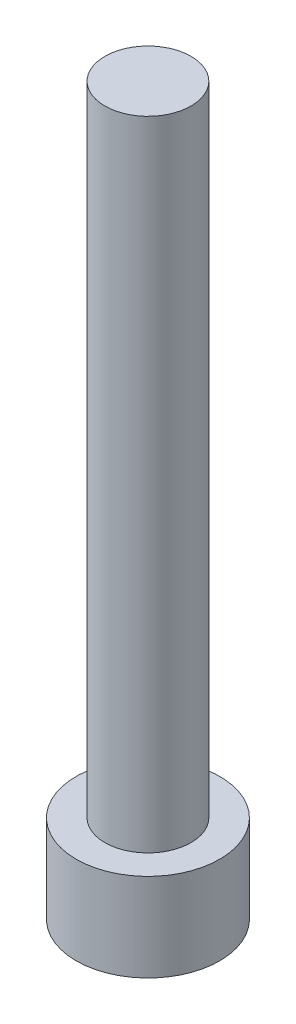
ISO-10303-21;
HEADER;
FILE_DESCRIPTION(('STEP AP214'),'2;1');
FILE_NAME('part.step','',(''),(''),'','','');
FILE_SCHEMA(('AUTOMOTIVE_DESIGN { 1 0 10303 214 1 1 1 1 }'));
ENDSEC;
DATA;
#1=APPLICATION_CONTEXT('core data for automotive mechanical design processes');
#2=APPLICATION_PROTOCOL_DEFINITION('international standard','automotive_design',2000,#1);
#3=PRODUCT_CONTEXT('',#1,'mechanical');
#4=PRODUCT('Part','Part','',(#3));
#5=PRODUCT_RELATED_PRODUCT_CATEGORY('part','',(#4));
#6=PRODUCT_DEFINITION_FORMATION('','',#4);
#7=PRODUCT_DEFINITION_CONTEXT('part definition',#1,'design');
#8=PRODUCT_DEFINITION('design','',#6,#7);
#9=PRODUCT_DEFINITION_SHAPE('','',#8);
#10=(LENGTH_UNIT() NAMED_UNIT(*) SI_UNIT(.MILLI.,.METRE.));
#11=(NAMED_UNIT(*) PLANE_ANGLE_UNIT() SI_UNIT($,.RADIAN.));
#12=(NAMED_UNIT(*) SI_UNIT($,.STERADIAN.) SOLID_ANGLE_UNIT());
#13=UNCERTAINTY_MEASURE_WITH_UNIT(LENGTH_MEASURE(1.E-05),#10,'distance_accuracy_value','');
#14=(GEOMETRIC_REPRESENTATION_CONTEXT(3) GLOBAL_UNCERTAINTY_ASSIGNED_CONTEXT((#13)) GLOBAL_UNIT_ASSIGNED_CONTEXT((#10,
#11,#12)) REPRESENTATION_CONTEXT('',''));
#15=CARTESIAN_POINT('',(0.,0.,0.));
#16=DIRECTION('',(0.,0.,1.));
#17=DIRECTION('',(1.,0.,0.));
#18=AXIS2_PLACEMENT_3D('',#15,#16,#17);
#19=CARTESIAN_POINT('',(0.,3.5052,0.));
#20=DIRECTION('',(0.,1.,0.));
#21=DIRECTION('',(0.,0.,1.));
#22=AXIS2_PLACEMENT_3D('',#19,#20,#21);
#23=PLANE('',#22);
#24=CARTESIAN_POINT('',(0.,3.5052,0.));
#25=DIRECTION('',(0.,1.,0.));
#26=DIRECTION('',(0.,0.,1.));
#27=AXIS2_PLACEMENT_3D('',#24,#25,#26);
#28=CIRCLE('',#27,2.8575);
#29=CARTESIAN_POINT('',(0.,3.5052,2.8575));
#30=VERTEX_POINT('',#29);
#31=EDGE_CURVE('E11',#30,#30,#28,.T.);
#32=ORIENTED_EDGE('',*,*,#31,.T.);
#33=EDGE_LOOP('',(#32));
#34=FACE_BOUND('',#33,.T.);
#35=CARTESIAN_POINT('',(0.,3.5052,0.));
#36=DIRECTION('',(0.,1.,0.));
#37=DIRECTION('',(0.,0.,1.));
#38=AXIS2_PLACEMENT_3D('',#35,#36,#37);
#39=CIRCLE('',#38,1.7145);
#40=CARTESIAN_POINT('',(0.,3.5052,1.7145));
#41=VERTEX_POINT('',#40);
#42=EDGE_CURVE('E152',#41,#41,#39,.T.);
#43=ORIENTED_EDGE('',*,*,#42,.F.);
#44=EDGE_LOOP('',(#43));
#45=FACE_BOUND('',#44,.T.);
#46=ADVANCED_FACE('F33',(#34,#45),#23,.T.);
#47=CARTESIAN_POINT('',(0.,3.5052,0.));
#48=DIRECTION('',(0.,-1.,0.));
#49=DIRECTION('',(0.,0.,-1.));
#50=AXIS2_PLACEMENT_3D('',#47,#48,#49);
#51=CYLINDRICAL_SURFACE('',#50,2.8575);
#52=ORIENTED_EDGE('',*,*,#31,.F.);
#53=EDGE_LOOP('',(#52));
#54=FACE_BOUND('',#53,.T.);
#55=CARTESIAN_POINT('',(0.,0.,0.));
#56=DIRECTION('',(0.,1.,0.));
#57=DIRECTION('',(0.,0.,1.));
#58=AXIS2_PLACEMENT_3D('',#55,#56,#57);
#59=CIRCLE('',#58,2.8575);
#60=CARTESIAN_POINT('',(0.,0.,2.8575));
#61=VERTEX_POINT('',#60);
#62=EDGE_CURVE('E37',#61,#61,#59,.T.);
#63=ORIENTED_EDGE('',*,*,#62,.T.);
#64=EDGE_LOOP('',(#63));
#65=FACE_BOUND('',#64,.T.);
#66=ADVANCED_FACE('F35',(#54,#65),#51,.T.);
#67=CARTESIAN_POINT('',(0.,0.,0.));
#68=DIRECTION('',(0.,1.,0.));
#69=DIRECTION('',(0.,0.,1.));
#70=AXIS2_PLACEMENT_3D('',#67,#68,#69);
#71=PLANE('',#70);
#72=DIRECTION('',(-0.500000000000001,0.,0.866025403784438));
#73=VECTOR('',#72,1.);
#74=CARTESIAN_POINT('',(1.60395121659243,0.,0.));
#75=LINE('',#74,#73);
#76=CARTESIAN_POINT('',(1.60395121659243,0.,0.));
#77=VERTEX_POINT('',#76);
#78=CARTESIAN_POINT('',(0.801975608296214,0.,1.3890625));
#79=VERTEX_POINT('',#78);
#80=EDGE_CURVE('E122',#77,#79,#75,.T.);
#81=ORIENTED_EDGE('',*,*,#80,.F.);
#82=DIRECTION('',(0.5,0.,0.866025403784439));
#83=VECTOR('',#82,1.);
#84=CARTESIAN_POINT('',(0.801975608296215,0.,-1.3890625));
#85=LINE('',#84,#83);
#86=CARTESIAN_POINT('',(0.801975608296215,0.,-1.3890625));
#87=VERTEX_POINT('',#86);
#88=EDGE_CURVE('E48',#87,#77,#85,.T.);
#89=ORIENTED_EDGE('',*,*,#88,.F.);
#90=DIRECTION('',(1.,0.,0.));
#91=VECTOR('',#90,1.);
#92=CARTESIAN_POINT('',(-0.801975608296214,0.,-1.3890625));
#93=LINE('',#92,#91);
#94=CARTESIAN_POINT('',(-0.801975608296214,0.,-1.3890625));
#95=VERTEX_POINT('',#94);
#96=EDGE_CURVE('E132',#95,#87,#93,.T.);
#97=ORIENTED_EDGE('',*,*,#96,.F.);
#98=DIRECTION('',(0.5,0.,-0.866025403784438));
#99=VECTOR('',#98,1.);
#100=CARTESIAN_POINT('',(-1.60395121659243,0.,0.));
#101=LINE('',#100,#99);
#102=CARTESIAN_POINT('',(-1.60395121659243,0.,0.));
#103=VERTEX_POINT('',#102);
#104=EDGE_CURVE('E130',#103,#95,#101,.T.);
#105=ORIENTED_EDGE('',*,*,#104,.F.);
#106=DIRECTION('',(-0.5,0.,-0.866025403784439));
#107=VECTOR('',#106,1.);
#108=CARTESIAN_POINT('',(-0.801975608296214,0.,1.3890625));
#109=LINE('',#108,#107);
#110=CARTESIAN_POINT('',(-0.801975608296214,0.,1.3890625));
#111=VERTEX_POINT('',#110);
#112=EDGE_CURVE('E96',#111,#103,#109,.T.);
#113=ORIENTED_EDGE('',*,*,#112,.F.);
#114=DIRECTION('',(-1.,0.,0.));
#115=VECTOR('',#114,1.);
#116=CARTESIAN_POINT('',(0.801975608296214,0.,1.3890625));
#117=LINE('',#116,#115);
#118=EDGE_CURVE('E126',#79,#111,#117,.T.);
#119=ORIENTED_EDGE('',*,*,#118,.F.);
#120=EDGE_LOOP('',(#81,#89,#97,#105,#113,#119));
#121=FACE_BOUND('',#120,.T.);
#122=ORIENTED_EDGE('',*,*,#62,.F.);
#123=EDGE_LOOP('',(#122));
#124=FACE_BOUND('',#123,.T.);
#125=ADVANCED_FACE('F145',(#121,#124),#71,.F.);
#126=CARTESIAN_POINT('',(0.801975608296215,1.9558,-1.3890625));
#127=DIRECTION('',(0.866025403784438,0.,-0.5));
#128=DIRECTION('',(-0.5,0.,-0.866025403784439));
#129=AXIS2_PLACEMENT_3D('',#126,#127,#128);
#130=PLANE('',#129);
#131=ORIENTED_EDGE('',*,*,#88,.T.);
#132=DIRECTION('',(0.,-1.,0.));
#133=VECTOR('',#132,1.);
#134=CARTESIAN_POINT('',(1.60395121659243,1.9558,0.));
#135=LINE('',#134,#133);
#136=CARTESIAN_POINT('',(1.60395121659243,1.9558,0.));
#137=VERTEX_POINT('',#136);
#138=EDGE_CURVE('E78',#137,#77,#135,.T.);
#139=ORIENTED_EDGE('',*,*,#138,.F.);
#140=DIRECTION('',(0.5,0.,0.866025403784439));
#141=VECTOR('',#140,1.);
#142=CARTESIAN_POINT('',(0.801975608296215,1.9558,-1.3890625));
#143=LINE('',#142,#141);
#144=CARTESIAN_POINT('',(0.801975608296215,1.9558,-1.3890625));
#145=VERTEX_POINT('',#144);
#146=EDGE_CURVE('E134',#145,#137,#143,.T.);
#147=ORIENTED_EDGE('',*,*,#146,.F.);
#148=DIRECTION('',(0.,-1.,0.));
#149=VECTOR('',#148,1.);
#150=CARTESIAN_POINT('',(0.801975608296215,1.9558,-1.3890625));
#151=LINE('',#150,#149);
#152=EDGE_CURVE('E56',#145,#87,#151,.T.);
#153=ORIENTED_EDGE('',*,*,#152,.T.);
#154=EDGE_LOOP('',(#131,#139,#147,#153));
#155=FACE_BOUND('',#154,.T.);
#156=ADVANCED_FACE('F174',(#155),#130,.F.);
#157=CARTESIAN_POINT('',(-0.801975608296214,1.9558,-1.3890625));
#158=DIRECTION('',(0.,0.,-1.));
#159=DIRECTION('',(-1.,0.,0.));
#160=AXIS2_PLACEMENT_3D('',#157,#158,#159);
#161=PLANE('',#160);
#162=ORIENTED_EDGE('',*,*,#96,.T.);
#163=ORIENTED_EDGE('',*,*,#152,.F.);
#164=DIRECTION('',(1.,0.,0.));
#165=VECTOR('',#164,1.);
#166=CARTESIAN_POINT('',(-0.801975608296214,1.9558,-1.3890625));
#167=LINE('',#166,#165);
#168=CARTESIAN_POINT('',(-0.801975608296214,1.9558,-1.3890625));
#169=VERTEX_POINT('',#168);
#170=EDGE_CURVE('E108',#169,#145,#167,.T.);
#171=ORIENTED_EDGE('',*,*,#170,.F.);
#172=DIRECTION('',(0.,-1.,0.));
#173=VECTOR('',#172,1.);
#174=CARTESIAN_POINT('',(-0.801975608296214,1.9558,-1.3890625));
#175=LINE('',#174,#173);
#176=EDGE_CURVE('E100',#169,#95,#175,.T.);
#177=ORIENTED_EDGE('',*,*,#176,.T.);
#178=EDGE_LOOP('',(#162,#163,#171,#177));
#179=FACE_BOUND('',#178,.T.);
#180=ADVANCED_FACE('F180',(#179),#161,.F.);
#181=CARTESIAN_POINT('',(-1.60395121659243,1.9558,0.));
#182=DIRECTION('',(-0.866025403784438,0.,-0.5));
#183=DIRECTION('',(-0.5,0.,0.866025403784439));
#184=AXIS2_PLACEMENT_3D('',#181,#182,#183);
#185=PLANE('',#184);
#186=ORIENTED_EDGE('',*,*,#104,.T.);
#187=ORIENTED_EDGE('',*,*,#176,.F.);
#188=DIRECTION('',(0.5,0.,-0.866025403784438));
#189=VECTOR('',#188,1.);
#190=CARTESIAN_POINT('',(-1.60395121659243,1.9558,0.));
#191=LINE('',#190,#189);
#192=CARTESIAN_POINT('',(-1.60395121659243,1.9558,0.));
#193=VERTEX_POINT('',#192);
#194=EDGE_CURVE('E104',#193,#169,#191,.T.);
#195=ORIENTED_EDGE('',*,*,#194,.F.);
#196=DIRECTION('',(0.,-1.,0.));
#197=VECTOR('',#196,1.);
#198=CARTESIAN_POINT('',(-1.60395121659243,1.9558,0.));
#199=LINE('',#198,#197);
#200=EDGE_CURVE('E89',#193,#103,#199,.T.);
#201=ORIENTED_EDGE('',*,*,#200,.T.);
#202=EDGE_LOOP('',(#186,#187,#195,#201));
#203=FACE_BOUND('',#202,.T.);
#204=ADVANCED_FACE('F105',(#203),#185,.F.);
#205=CARTESIAN_POINT('',(-0.801975608296214,1.9558,1.3890625));
#206=DIRECTION('',(-0.866025403784439,0.,0.5));
#207=DIRECTION('',(0.5,0.,0.866025403784439));
#208=AXIS2_PLACEMENT_3D('',#205,#206,#207);
#209=PLANE('',#208);
#210=ORIENTED_EDGE('',*,*,#112,.T.);
#211=ORIENTED_EDGE('',*,*,#200,.F.);
#212=DIRECTION('',(-0.5,0.,-0.866025403784439));
#213=VECTOR('',#212,1.);
#214=CARTESIAN_POINT('',(-0.801975608296214,1.9558,1.3890625));
#215=LINE('',#214,#213);
#216=CARTESIAN_POINT('',(-0.801975608296214,1.9558,1.3890625));
#217=VERTEX_POINT('',#216);
#218=EDGE_CURVE('E93',#217,#193,#215,.T.);
#219=ORIENTED_EDGE('',*,*,#218,.F.);
#220=DIRECTION('',(0.,-1.,0.));
#221=VECTOR('',#220,1.);
#222=CARTESIAN_POINT('',(-0.801975608296214,1.9558,1.3890625));
#223=LINE('',#222,#221);
#224=EDGE_CURVE('E101',#217,#111,#223,.T.);
#225=ORIENTED_EDGE('',*,*,#224,.T.);
#226=EDGE_LOOP('',(#210,#211,#219,#225));
#227=FACE_BOUND('',#226,.T.);
#228=ADVANCED_FACE('F91',(#227),#209,.F.);
#229=CARTESIAN_POINT('',(0.801975608296214,1.9558,1.3890625));
#230=DIRECTION('',(0.,0.,1.));
#231=DIRECTION('',(1.,0.,0.));
#232=AXIS2_PLACEMENT_3D('',#229,#230,#231);
#233=PLANE('',#232);
#234=ORIENTED_EDGE('',*,*,#118,.T.);
#235=ORIENTED_EDGE('',*,*,#224,.F.);
#236=DIRECTION('',(-1.,0.,0.));
#237=VECTOR('',#236,1.);
#238=CARTESIAN_POINT('',(0.801975608296214,1.9558,1.3890625));
#239=LINE('',#238,#237);
#240=CARTESIAN_POINT('',(0.801975608296214,1.9558,1.3890625));
#241=VERTEX_POINT('',#240);
#242=EDGE_CURVE('E114',#241,#217,#239,.T.);
#243=ORIENTED_EDGE('',*,*,#242,.F.);
#244=DIRECTION('',(0.,-1.,0.));
#245=VECTOR('',#244,1.);
#246=CARTESIAN_POINT('',(0.801975608296214,1.9558,1.3890625));
#247=LINE('',#246,#245);
#248=EDGE_CURVE('E138',#241,#79,#247,.T.);
#249=ORIENTED_EDGE('',*,*,#248,.T.);
#250=EDGE_LOOP('',(#234,#235,#243,#249));
#251=FACE_BOUND('',#250,.T.);
#252=ADVANCED_FACE('F149',(#251),#233,.F.);
#253=CARTESIAN_POINT('',(1.60395121659243,1.9558,0.));
#254=DIRECTION('',(0.866025403784438,0.,0.500000000000001));
#255=DIRECTION('',(0.500000000000001,0.,-0.866025403784438));
#256=AXIS2_PLACEMENT_3D('',#253,#254,#255);
#257=PLANE('',#256);
#258=ORIENTED_EDGE('',*,*,#80,.T.);
#259=ORIENTED_EDGE('',*,*,#248,.F.);
#260=DIRECTION('',(-0.500000000000001,0.,0.866025403784438));
#261=VECTOR('',#260,1.);
#262=CARTESIAN_POINT('',(1.60395121659243,1.9558,0.));
#263=LINE('',#262,#261);
#264=EDGE_CURVE('E116',#137,#241,#263,.T.);
#265=ORIENTED_EDGE('',*,*,#264,.F.);
#266=ORIENTED_EDGE('',*,*,#138,.T.);
#267=EDGE_LOOP('',(#258,#259,#265,#266));
#268=FACE_BOUND('',#267,.T.);
#269=ADVANCED_FACE('F142',(#268),#257,.F.);
#270=CARTESIAN_POINT('',(0.,1.9558,0.));
#271=DIRECTION('',(0.,-1.,0.));
#272=DIRECTION('',(0.,0.,-1.));
#273=AXIS2_PLACEMENT_3D('',#270,#271,#272);
#274=PLANE('',#273);
#275=ORIENTED_EDGE('',*,*,#146,.T.);
#276=ORIENTED_EDGE('',*,*,#264,.T.);
#277=ORIENTED_EDGE('',*,*,#242,.T.);
#278=ORIENTED_EDGE('',*,*,#218,.T.);
#279=ORIENTED_EDGE('',*,*,#194,.T.);
#280=ORIENTED_EDGE('',*,*,#170,.T.);
#281=EDGE_LOOP('',(#275,#276,#277,#278,#279,#280));
#282=FACE_BOUND('',#281,.T.);
#283=ADVANCED_FACE('F111',(#282),#274,.T.);
#284=CARTESIAN_POINT('',(0.,28.9052,0.));
#285=DIRECTION('',(0.,-1.,0.));
#286=DIRECTION('',(0.,0.,-1.));
#287=AXIS2_PLACEMENT_3D('',#284,#285,#286);
#288=CYLINDRICAL_SURFACE('',#287,1.7145);
#289=CARTESIAN_POINT('',(0.,28.9052,0.));
#290=DIRECTION('',(0.,1.,0.));
#291=DIRECTION('',(0.,0.,1.));
#292=AXIS2_PLACEMENT_3D('',#289,#290,#291);
#293=CIRCLE('',#292,1.7145);
#294=CARTESIAN_POINT('',(0.,28.9052,1.7145));
#295=VERTEX_POINT('',#294);
#296=EDGE_CURVE('E123',#295,#295,#293,.T.);
#297=ORIENTED_EDGE('',*,*,#296,.F.);
#298=EDGE_LOOP('',(#297));
#299=FACE_BOUND('',#298,.T.);
#300=ORIENTED_EDGE('',*,*,#42,.T.);
#301=EDGE_LOOP('',(#300));
#302=FACE_BOUND('',#301,.T.);
#303=ADVANCED_FACE('F160',(#299,#302),#288,.T.);
#304=CARTESIAN_POINT('',(0.,28.9052,0.));
#305=DIRECTION('',(0.,1.,0.));
#306=DIRECTION('',(0.,0.,1.));
#307=AXIS2_PLACEMENT_3D('',#304,#305,#306);
#308=PLANE('',#307);
#309=ORIENTED_EDGE('',*,*,#296,.T.);
#310=EDGE_LOOP('',(#309));
#311=FACE_BOUND('',#310,.T.);
#312=ADVANCED_FACE('F158',(#311),#308,.T.);
#313=CLOSED_SHELL('',(#46,#66,#125,#156,#180,#204,#228,#252,#269,#283,#303,#312));
#314=MANIFOLD_SOLID_BREP('B2',#313);
#315=ADVANCED_BREP_SHAPE_REPRESENTATION('',(#18,#314),#14);
#316=SHAPE_DEFINITION_REPRESENTATION(#9,#315);
ENDSEC;
END-ISO-10303-21;
